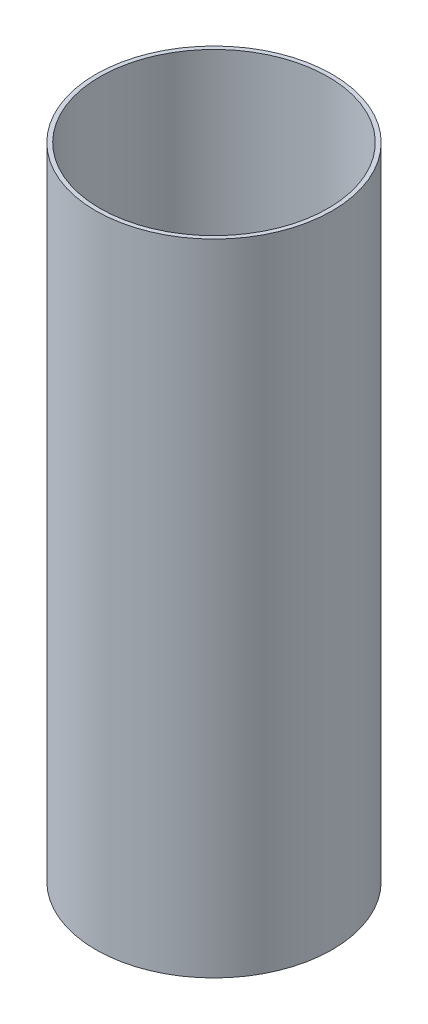
ISO-10303-21;
HEADER;
FILE_DESCRIPTION(('STEP AP214'),'2;1');
FILE_NAME('part.step','',(''),(''),'','','');
FILE_SCHEMA(('AUTOMOTIVE_DESIGN { 1 0 10303 214 1 1 1 1 }'));
ENDSEC;
DATA;
#1=APPLICATION_CONTEXT('core data for automotive mechanical design processes');
#2=APPLICATION_PROTOCOL_DEFINITION('international standard','automotive_design',2000,#1);
#3=PRODUCT_CONTEXT('',#1,'mechanical');
#4=PRODUCT('Part','Part','',(#3));
#5=PRODUCT_RELATED_PRODUCT_CATEGORY('part','',(#4));
#6=PRODUCT_DEFINITION_FORMATION('','',#4);
#7=PRODUCT_DEFINITION_CONTEXT('part definition',#1,'design');
#8=PRODUCT_DEFINITION('design','',#6,#7);
#9=PRODUCT_DEFINITION_SHAPE('','',#8);
#10=(LENGTH_UNIT() NAMED_UNIT(*) SI_UNIT(.MILLI.,.METRE.));
#11=(NAMED_UNIT(*) PLANE_ANGLE_UNIT() SI_UNIT($,.RADIAN.));
#12=(NAMED_UNIT(*) SI_UNIT($,.STERADIAN.) SOLID_ANGLE_UNIT());
#13=UNCERTAINTY_MEASURE_WITH_UNIT(LENGTH_MEASURE(1.E-05),#10,'distance_accuracy_value','');
#14=(GEOMETRIC_REPRESENTATION_CONTEXT(3) GLOBAL_UNCERTAINTY_ASSIGNED_CONTEXT((#13)) GLOBAL_UNIT_ASSIGNED_CONTEXT((#10,
#11,#12)) REPRESENTATION_CONTEXT('',''));
#15=CARTESIAN_POINT('',(0.,0.,0.));
#16=DIRECTION('',(0.,0.,1.));
#17=DIRECTION('',(1.,0.,0.));
#18=AXIS2_PLACEMENT_3D('',#15,#16,#17);
#19=CARTESIAN_POINT('',(0.,230.,0.));
#20=DIRECTION('',(0.,1.,0.));
#21=DIRECTION('',(0.,0.,1.));
#22=AXIS2_PLACEMENT_3D('',#19,#20,#21);
#23=PLANE('',#22);
#24=CARTESIAN_POINT('',(0.,230.,0.));
#25=DIRECTION('',(0.,1.,0.));
#26=DIRECTION('',(0.,0.,1.));
#27=AXIS2_PLACEMENT_3D('',#24,#25,#26);
#28=CIRCLE('',#27,42.5);
#29=CARTESIAN_POINT('',(0.,230.,42.5));
#30=VERTEX_POINT('',#29);
#31=EDGE_CURVE('E10',#30,#30,#28,.T.);
#32=ORIENTED_EDGE('',*,*,#31,.T.);
#33=EDGE_LOOP('',(#32));
#34=FACE_BOUND('',#33,.T.);
#35=CARTESIAN_POINT('',(0.,230.,0.));
#36=DIRECTION('',(0.,1.,0.));
#37=DIRECTION('',(0.,0.,1.));
#38=AXIS2_PLACEMENT_3D('',#35,#36,#37);
#39=CIRCLE('',#38,41.);
#40=CARTESIAN_POINT('',(0.,230.,41.));
#41=VERTEX_POINT('',#40);
#42=EDGE_CURVE('E50',#41,#41,#39,.T.);
#43=ORIENTED_EDGE('',*,*,#42,.F.);
#44=EDGE_LOOP('',(#43));
#45=FACE_BOUND('',#44,.T.);
#46=ADVANCED_FACE('F39',(#34,#45),#23,.T.);
#47=CARTESIAN_POINT('',(0.,0.,0.));
#48=DIRECTION('',(0.,1.,0.));
#49=DIRECTION('',(0.,0.,1.));
#50=AXIS2_PLACEMENT_3D('',#47,#48,#49);
#51=PLANE('',#50);
#52=CARTESIAN_POINT('',(0.,0.,0.));
#53=DIRECTION('',(0.,1.,0.));
#54=DIRECTION('',(0.,0.,1.));
#55=AXIS2_PLACEMENT_3D('',#52,#53,#54);
#56=CIRCLE('',#55,42.5);
#57=CARTESIAN_POINT('',(0.,0.,42.5));
#58=VERTEX_POINT('',#57);
#59=EDGE_CURVE('E43',#58,#58,#56,.T.);
#60=ORIENTED_EDGE('',*,*,#59,.F.);
#61=EDGE_LOOP('',(#60));
#62=FACE_BOUND('',#61,.T.);
#63=CARTESIAN_POINT('',(0.,0.,0.));
#64=DIRECTION('',(0.,1.,0.));
#65=DIRECTION('',(0.,0.,1.));
#66=AXIS2_PLACEMENT_3D('',#63,#64,#65);
#67=CIRCLE('',#66,41.);
#68=CARTESIAN_POINT('',(0.,0.,41.));
#69=VERTEX_POINT('',#68);
#70=EDGE_CURVE('E52',#69,#69,#67,.T.);
#71=ORIENTED_EDGE('',*,*,#70,.T.);
#72=EDGE_LOOP('',(#71));
#73=FACE_BOUND('',#72,.T.);
#74=ADVANCED_FACE('F62',(#62,#73),#51,.F.);
#75=CARTESIAN_POINT('',(0.,230.,0.));
#76=DIRECTION('',(0.,-1.,0.));
#77=DIRECTION('',(0.,0.,-1.));
#78=AXIS2_PLACEMENT_3D('',#75,#76,#77);
#79=CYLINDRICAL_SURFACE('',#78,42.5);
#80=ORIENTED_EDGE('',*,*,#31,.F.);
#81=EDGE_LOOP('',(#80));
#82=FACE_BOUND('',#81,.T.);
#83=ORIENTED_EDGE('',*,*,#59,.T.);
#84=EDGE_LOOP('',(#83));
#85=FACE_BOUND('',#84,.T.);
#86=ADVANCED_FACE('F41',(#82,#85),#79,.T.);
#87=CARTESIAN_POINT('',(0.,230.,0.));
#88=DIRECTION('',(0.,-1.,0.));
#89=DIRECTION('',(0.,0.,-1.));
#90=AXIS2_PLACEMENT_3D('',#87,#88,#89);
#91=CYLINDRICAL_SURFACE('',#90,41.);
#92=ORIENTED_EDGE('',*,*,#42,.T.);
#93=EDGE_LOOP('',(#92));
#94=FACE_BOUND('',#93,.T.);
#95=ORIENTED_EDGE('',*,*,#70,.F.);
#96=EDGE_LOOP('',(#95));
#97=FACE_BOUND('',#96,.T.);
#98=ADVANCED_FACE('F58',(#94,#97),#91,.F.);
#99=CLOSED_SHELL('',(#46,#74,#86,#98));
#100=MANIFOLD_SOLID_BREP('B2',#99);
#101=ADVANCED_BREP_SHAPE_REPRESENTATION('',(#18,#100),#14);
#102=SHAPE_DEFINITION_REPRESENTATION(#9,#101);
ENDSEC;
END-ISO-10303-21;
